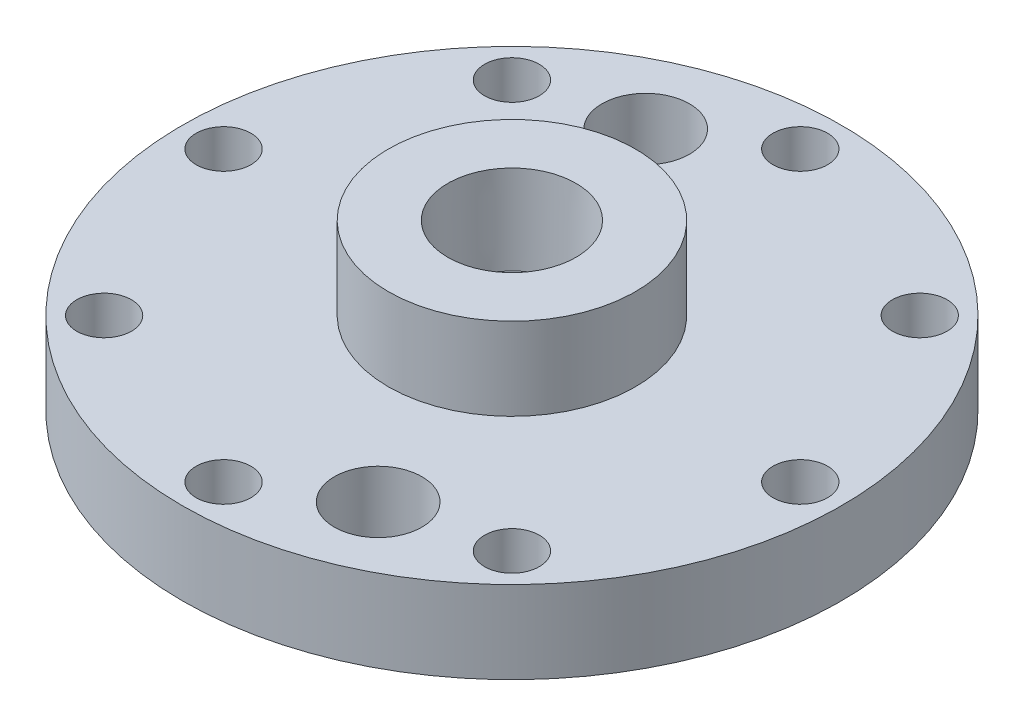
ISO-10303-21;
HEADER;
FILE_DESCRIPTION(('STEP AP214'),'2;1');
FILE_NAME('part.step','',(''),(''),'','','');
FILE_SCHEMA(('AUTOMOTIVE_DESIGN { 1 0 10303 214 1 1 1 1 }'));
ENDSEC;
DATA;
#1=APPLICATION_CONTEXT('core data for automotive mechanical design processes');
#2=APPLICATION_PROTOCOL_DEFINITION('international standard','automotive_design',2000,#1);
#3=PRODUCT_CONTEXT('',#1,'mechanical');
#4=PRODUCT('Part','Part','',(#3));
#5=PRODUCT_RELATED_PRODUCT_CATEGORY('part','',(#4));
#6=PRODUCT_DEFINITION_FORMATION('','',#4);
#7=PRODUCT_DEFINITION_CONTEXT('part definition',#1,'design');
#8=PRODUCT_DEFINITION('design','',#6,#7);
#9=PRODUCT_DEFINITION_SHAPE('','',#8);
#10=(LENGTH_UNIT() NAMED_UNIT(*) SI_UNIT(.MILLI.,.METRE.));
#11=(NAMED_UNIT(*) PLANE_ANGLE_UNIT() SI_UNIT($,.RADIAN.));
#12=(NAMED_UNIT(*) SI_UNIT($,.STERADIAN.) SOLID_ANGLE_UNIT());
#13=UNCERTAINTY_MEASURE_WITH_UNIT(LENGTH_MEASURE(1.E-05),#10,'distance_accuracy_value','');
#14=(GEOMETRIC_REPRESENTATION_CONTEXT(3) GLOBAL_UNCERTAINTY_ASSIGNED_CONTEXT((#13)) GLOBAL_UNIT_ASSIGNED_CONTEXT((#10,
#11,#12)) REPRESENTATION_CONTEXT('',''));
#15=CARTESIAN_POINT('',(0.,0.,0.));
#16=DIRECTION('',(0.,0.,1.));
#17=DIRECTION('',(1.,0.,0.));
#18=AXIS2_PLACEMENT_3D('',#15,#16,#17);
#19=CARTESIAN_POINT('',(-15.875,0.,0.));
#20=DIRECTION('',(0.,-1.,0.));
#21=DIRECTION('',(0.,0.,-1.));
#22=AXIS2_PLACEMENT_3D('',#19,#20,#21);
#23=PLANE('',#22);
#24=CARTESIAN_POINT('',(0.,0.,0.));
#25=DIRECTION('',(0.,1.,0.));
#26=DIRECTION('',(0.,0.,1.));
#27=AXIS2_PLACEMENT_3D('',#24,#25,#26);
#28=CIRCLE('',#27,8.9281);
#29=CARTESIAN_POINT('',(0.,0.,8.9281));
#30=VERTEX_POINT('',#29);
#31=EDGE_CURVE('E76',#30,#30,#28,.T.);
#32=ORIENTED_EDGE('',*,*,#31,.T.);
#33=EDGE_LOOP('',(#32));
#34=FACE_BOUND('',#33,.T.);
#35=CARTESIAN_POINT('',(0.,0.,0.));
#36=DIRECTION('',(0.,1.,0.));
#37=DIRECTION('',(0.,0.,1.));
#38=AXIS2_PLACEMENT_3D('',#35,#36,#37);
#39=CIRCLE('',#38,15.875);
#40=CARTESIAN_POINT('',(0.,0.,15.875));
#41=VERTEX_POINT('',#40);
#42=EDGE_CURVE('E10',#41,#41,#39,.T.);
#43=ORIENTED_EDGE('',*,*,#42,.F.);
#44=EDGE_LOOP('',(#43));
#45=FACE_BOUND('',#44,.T.);
#46=ADVANCED_FACE('F45',(#34,#45),#23,.T.);
#47=CARTESIAN_POINT('',(0.,25.4,0.));
#48=DIRECTION('',(0.,1.,0.));
#49=DIRECTION('',(0.,0.,1.));
#50=AXIS2_PLACEMENT_3D('',#47,#48,#49);
#51=CYLINDRICAL_SURFACE('',#50,15.875);
#52=ORIENTED_EDGE('',*,*,#42,.T.);
#53=EDGE_LOOP('',(#52));
#54=FACE_BOUND('',#53,.T.);
#55=CARTESIAN_POINT('',(0.,2.54,0.));
#56=DIRECTION('',(0.,1.,0.));
#57=DIRECTION('',(0.,0.,1.));
#58=AXIS2_PLACEMENT_3D('',#55,#56,#57);
#59=CIRCLE('',#58,15.875);
#60=CARTESIAN_POINT('',(0.,2.54,15.875));
#61=VERTEX_POINT('',#60);
#62=EDGE_CURVE('E51',#61,#61,#59,.T.);
#63=ORIENTED_EDGE('',*,*,#62,.F.);
#64=EDGE_LOOP('',(#63));
#65=FACE_BOUND('',#64,.T.);
#66=ADVANCED_FACE('F197',(#54,#65),#51,.T.);
#67=CARTESIAN_POINT('',(-19.431,2.54,0.));
#68=DIRECTION('',(0.,-1.,0.));
#69=DIRECTION('',(0.,0.,-1.));
#70=AXIS2_PLACEMENT_3D('',#67,#68,#69);
#71=PLANE('',#70);
#72=ORIENTED_EDGE('',*,*,#62,.T.);
#73=EDGE_LOOP('',(#72));
#74=FACE_BOUND('',#73,.T.);
#75=CARTESIAN_POINT('',(0.,2.54,0.));
#76=DIRECTION('',(0.,1.,0.));
#77=DIRECTION('',(0.,0.,1.));
#78=AXIS2_PLACEMENT_3D('',#75,#76,#77);
#79=CIRCLE('',#78,19.431);
#80=CARTESIAN_POINT('',(0.,2.54,19.431));
#81=VERTEX_POINT('',#80);
#82=EDGE_CURVE('E55',#81,#81,#79,.T.);
#83=ORIENTED_EDGE('',*,*,#82,.F.);
#84=EDGE_LOOP('',(#83));
#85=FACE_BOUND('',#84,.T.);
#86=ADVANCED_FACE('F202',(#74,#85),#71,.T.);
#87=CARTESIAN_POINT('',(0.,25.4,0.));
#88=DIRECTION('',(0.,1.,0.));
#89=DIRECTION('',(0.,0.,1.));
#90=AXIS2_PLACEMENT_3D('',#87,#88,#89);
#91=CYLINDRICAL_SURFACE('',#90,19.431);
#92=ORIENTED_EDGE('',*,*,#82,.T.);
#93=EDGE_LOOP('',(#92));
#94=FACE_BOUND('',#93,.T.);
#95=CARTESIAN_POINT('',(0.,0.,0.));
#96=DIRECTION('',(0.,1.,0.));
#97=DIRECTION('',(0.,0.,1.));
#98=AXIS2_PLACEMENT_3D('',#95,#96,#97);
#99=CIRCLE('',#98,19.431);
#100=CARTESIAN_POINT('',(0.,0.,19.431));
#101=VERTEX_POINT('',#100);
#102=EDGE_CURVE('E59',#101,#101,#99,.T.);
#103=ORIENTED_EDGE('',*,*,#102,.F.);
#104=EDGE_LOOP('',(#103));
#105=FACE_BOUND('',#104,.T.);
#106=ADVANCED_FACE('F265',(#94,#105),#91,.F.);
#107=CARTESIAN_POINT('',(-19.431,0.,0.));
#108=DIRECTION('',(0.,-1.,0.));
#109=DIRECTION('',(0.,0.,-1.));
#110=AXIS2_PLACEMENT_3D('',#107,#108,#109);
#111=PLANE('',#110);
#112=CARTESIAN_POINT('',(14.5802387731099,0.,35.19981018868));
#113=DIRECTION('',(0.,1.,0.));
#114=DIRECTION('',(0.,0.,1.));
#115=AXIS2_PLACEMENT_3D('',#112,#113,#114);
#116=CIRCLE('',#115,6.74624);
#117=CARTESIAN_POINT('',(14.5802387731099,0.,41.94605018868));
#118=VERTEX_POINT('',#117);
#119=EDGE_CURVE('E142',#118,#118,#116,.T.);
#120=ORIENTED_EDGE('',*,*,#119,.T.);
#121=EDGE_LOOP('',(#120));
#122=FACE_BOUND('',#121,.T.);
#123=CARTESIAN_POINT('',(-14.5802387731099,0.,-35.19981018868));
#124=DIRECTION('',(0.,1.,0.));
#125=DIRECTION('',(0.,0.,1.));
#126=AXIS2_PLACEMENT_3D('',#123,#124,#125);
#127=CIRCLE('',#126,6.74624);
#128=CARTESIAN_POINT('',(-14.5802387731099,0.,-28.45357018868));
#129=VERTEX_POINT('',#128);
#130=EDGE_CURVE('E136',#129,#129,#127,.T.);
#131=ORIENTED_EDGE('',*,*,#130,.T.);
#132=EDGE_LOOP('',(#131));
#133=FACE_BOUND('',#132,.T.);
#134=CARTESIAN_POINT('',(31.4308964237424,0.,-31.4308964237417));
#135=DIRECTION('',(0.,1.,0.));
#136=DIRECTION('',(0.,0.,1.));
#137=AXIS2_PLACEMENT_3D('',#134,#135,#136);
#138=CIRCLE('',#137,4.21639999999999);
#139=CARTESIAN_POINT('',(31.4308964237424,0.,-27.2144964237417));
#140=VERTEX_POINT('',#139);
#141=EDGE_CURVE('E130',#140,#140,#138,.T.);
#142=ORIENTED_EDGE('',*,*,#141,.T.);
#143=EDGE_LOOP('',(#142));
#144=FACE_BOUND('',#143,.T.);
#145=CARTESIAN_POINT('',(4.65589036534732E-13,0.,-44.45));
#146=DIRECTION('',(0.,1.,0.));
#147=DIRECTION('',(0.,0.,1.));
#148=AXIS2_PLACEMENT_3D('',#145,#146,#147);
#149=CIRCLE('',#148,4.2164);
#150=CARTESIAN_POINT('',(4.65589036534732E-13,0.,-40.2336));
#151=VERTEX_POINT('',#150);
#152=EDGE_CURVE('E124',#151,#151,#149,.T.);
#153=ORIENTED_EDGE('',*,*,#152,.T.);
#154=EDGE_LOOP('',(#153));
#155=FACE_BOUND('',#154,.T.);
#156=CARTESIAN_POINT('',(-31.4308964237418,0.,-31.4308964237423));
#157=DIRECTION('',(0.,1.,0.));
#158=DIRECTION('',(0.,0.,1.));
#159=AXIS2_PLACEMENT_3D('',#156,#157,#158);
#160=CIRCLE('',#159,4.21639999999999);
#161=CARTESIAN_POINT('',(-31.4308964237418,0.,-27.2144964237423));
#162=VERTEX_POINT('',#161);
#163=EDGE_CURVE('E118',#162,#162,#160,.T.);
#164=ORIENTED_EDGE('',*,*,#163,.T.);
#165=EDGE_LOOP('',(#164));
#166=FACE_BOUND('',#165,.T.);
#167=CARTESIAN_POINT('',(-44.45,0.,0.));
#168=DIRECTION('',(0.,1.,0.));
#169=DIRECTION('',(0.,0.,1.));
#170=AXIS2_PLACEMENT_3D('',#167,#168,#169);
#171=CIRCLE('',#170,4.21639999999999);
#172=CARTESIAN_POINT('',(-44.45,0.,4.21639999999999));
#173=VERTEX_POINT('',#172);
#174=EDGE_CURVE('E112',#173,#173,#171,.T.);
#175=ORIENTED_EDGE('',*,*,#174,.T.);
#176=EDGE_LOOP('',(#175));
#177=FACE_BOUND('',#176,.T.);
#178=CARTESIAN_POINT('',(-31.4308964237422,0.,31.4308964237419));
#179=DIRECTION('',(0.,1.,0.));
#180=DIRECTION('',(0.,0.,1.));
#181=AXIS2_PLACEMENT_3D('',#178,#179,#180);
#182=CIRCLE('',#181,4.21639999999999);
#183=CARTESIAN_POINT('',(-31.4308964237422,0.,35.6472964237419));
#184=VERTEX_POINT('',#183);
#185=EDGE_CURVE('E106',#184,#184,#182,.T.);
#186=ORIENTED_EDGE('',*,*,#185,.T.);
#187=EDGE_LOOP('',(#186));
#188=FACE_BOUND('',#187,.T.);
#189=CARTESIAN_POINT('',(-1.55196345511577E-13,0.,44.45));
#190=DIRECTION('',(0.,1.,0.));
#191=DIRECTION('',(0.,0.,1.));
#192=AXIS2_PLACEMENT_3D('',#189,#190,#191);
#193=CIRCLE('',#192,4.2164);
#194=CARTESIAN_POINT('',(-1.55196345511577E-13,0.,48.6664));
#195=VERTEX_POINT('',#194);
#196=EDGE_CURVE('E100',#195,#195,#193,.T.);
#197=ORIENTED_EDGE('',*,*,#196,.T.);
#198=EDGE_LOOP('',(#197));
#199=FACE_BOUND('',#198,.T.);
#200=CARTESIAN_POINT('',(31.430896423742,0.,31.4308964237421));
#201=DIRECTION('',(0.,1.,0.));
#202=DIRECTION('',(0.,0.,1.));
#203=AXIS2_PLACEMENT_3D('',#200,#201,#202);
#204=CIRCLE('',#203,4.21639999999999);
#205=CARTESIAN_POINT('',(31.430896423742,0.,35.6472964237421));
#206=VERTEX_POINT('',#205);
#207=EDGE_CURVE('E94',#206,#206,#204,.T.);
#208=ORIENTED_EDGE('',*,*,#207,.T.);
#209=EDGE_LOOP('',(#208));
#210=FACE_BOUND('',#209,.T.);
#211=CARTESIAN_POINT('',(44.45,0.,0.));
#212=DIRECTION('',(0.,1.,0.));
#213=DIRECTION('',(0.,0.,1.));
#214=AXIS2_PLACEMENT_3D('',#211,#212,#213);
#215=CIRCLE('',#214,4.21639999999999);
#216=CARTESIAN_POINT('',(44.45,0.,4.21639999999999));
#217=VERTEX_POINT('',#216);
#218=EDGE_CURVE('E88',#217,#217,#215,.T.);
#219=ORIENTED_EDGE('',*,*,#218,.T.);
#220=EDGE_LOOP('',(#219));
#221=FACE_BOUND('',#220,.T.);
#222=ORIENTED_EDGE('',*,*,#102,.T.);
#223=EDGE_LOOP('',(#222));
#224=FACE_BOUND('',#223,.T.);
#225=CARTESIAN_POINT('',(0.,0.,0.));
#226=DIRECTION('',(0.,1.,0.));
#227=DIRECTION('',(0.,0.,1.));
#228=AXIS2_PLACEMENT_3D('',#225,#226,#227);
#229=CIRCLE('',#228,50.8);
#230=CARTESIAN_POINT('',(0.,0.,50.8));
#231=VERTEX_POINT('',#230);
#232=EDGE_CURVE('E64',#231,#231,#229,.T.);
#233=ORIENTED_EDGE('',*,*,#232,.F.);
#234=EDGE_LOOP('',(#233));
#235=FACE_BOUND('',#234,.T.);
#236=ADVANCED_FACE('F262',(#122,#133,#144,#155,#166,#177,#188,#199,#210,#221,#224,#235),#111,.T.);
#237=CARTESIAN_POINT('',(0.,25.4,0.));
#238=DIRECTION('',(0.,1.,0.));
#239=DIRECTION('',(0.,0.,1.));
#240=AXIS2_PLACEMENT_3D('',#237,#238,#239);
#241=CYLINDRICAL_SURFACE('',#240,50.8);
#242=ORIENTED_EDGE('',*,*,#232,.T.);
#243=EDGE_LOOP('',(#242));
#244=FACE_BOUND('',#243,.T.);
#245=CARTESIAN_POINT('',(0.,12.7,0.));
#246=DIRECTION('',(0.,1.,0.));
#247=DIRECTION('',(0.,0.,1.));
#248=AXIS2_PLACEMENT_3D('',#245,#246,#247);
#249=CIRCLE('',#248,50.8);
#250=CARTESIAN_POINT('',(0.,12.7,50.8));
#251=VERTEX_POINT('',#250);
#252=EDGE_CURVE('E67',#251,#251,#249,.T.);
#253=ORIENTED_EDGE('',*,*,#252,.F.);
#254=EDGE_LOOP('',(#253));
#255=FACE_BOUND('',#254,.T.);
#256=ADVANCED_FACE('F155',(#244,#255),#241,.T.);
#257=CARTESIAN_POINT('',(-50.8,12.7,0.));
#258=DIRECTION('',(0.,1.,0.));
#259=DIRECTION('',(0.,0.,1.));
#260=AXIS2_PLACEMENT_3D('',#257,#258,#259);
#261=PLANE('',#260);
#262=CARTESIAN_POINT('',(14.5802387731099,12.7,35.19981018868));
#263=DIRECTION('',(0.,1.,0.));
#264=DIRECTION('',(0.,0.,1.));
#265=AXIS2_PLACEMENT_3D('',#262,#263,#264);
#266=CIRCLE('',#265,6.74624);
#267=CARTESIAN_POINT('',(14.5802387731099,12.7,41.94605018868));
#268=VERTEX_POINT('',#267);
#269=EDGE_CURVE('E145',#268,#268,#266,.T.);
#270=ORIENTED_EDGE('',*,*,#269,.F.);
#271=EDGE_LOOP('',(#270));
#272=FACE_BOUND('',#271,.T.);
#273=CARTESIAN_POINT('',(-14.5802387731099,12.7,-35.19981018868));
#274=DIRECTION('',(0.,1.,0.));
#275=DIRECTION('',(0.,0.,1.));
#276=AXIS2_PLACEMENT_3D('',#273,#274,#275);
#277=CIRCLE('',#276,6.74624);
#278=CARTESIAN_POINT('',(-14.5802387731099,12.7,-28.45357018868));
#279=VERTEX_POINT('',#278);
#280=EDGE_CURVE('E139',#279,#279,#277,.T.);
#281=ORIENTED_EDGE('',*,*,#280,.F.);
#282=EDGE_LOOP('',(#281));
#283=FACE_BOUND('',#282,.T.);
#284=CARTESIAN_POINT('',(31.4308964237424,12.7,-31.4308964237417));
#285=DIRECTION('',(0.,1.,0.));
#286=DIRECTION('',(0.,0.,1.));
#287=AXIS2_PLACEMENT_3D('',#284,#285,#286);
#288=CIRCLE('',#287,4.21639999999999);
#289=CARTESIAN_POINT('',(31.4308964237424,12.7,-27.2144964237417));
#290=VERTEX_POINT('',#289);
#291=EDGE_CURVE('E133',#290,#290,#288,.T.);
#292=ORIENTED_EDGE('',*,*,#291,.F.);
#293=EDGE_LOOP('',(#292));
#294=FACE_BOUND('',#293,.T.);
#295=CARTESIAN_POINT('',(4.65589036534732E-13,12.7,-44.45));
#296=DIRECTION('',(0.,1.,0.));
#297=DIRECTION('',(0.,0.,1.));
#298=AXIS2_PLACEMENT_3D('',#295,#296,#297);
#299=CIRCLE('',#298,4.2164);
#300=CARTESIAN_POINT('',(4.65589036534732E-13,12.7,-40.2336));
#301=VERTEX_POINT('',#300);
#302=EDGE_CURVE('E127',#301,#301,#299,.T.);
#303=ORIENTED_EDGE('',*,*,#302,.F.);
#304=EDGE_LOOP('',(#303));
#305=FACE_BOUND('',#304,.T.);
#306=CARTESIAN_POINT('',(-31.4308964237418,12.7,-31.4308964237423));
#307=DIRECTION('',(0.,1.,0.));
#308=DIRECTION('',(0.,0.,1.));
#309=AXIS2_PLACEMENT_3D('',#306,#307,#308);
#310=CIRCLE('',#309,4.2164);
#311=CARTESIAN_POINT('',(-31.4308964237418,12.7,-27.2144964237423));
#312=VERTEX_POINT('',#311);
#313=EDGE_CURVE('E121',#312,#312,#310,.T.);
#314=ORIENTED_EDGE('',*,*,#313,.F.);
#315=EDGE_LOOP('',(#314));
#316=FACE_BOUND('',#315,.T.);
#317=CARTESIAN_POINT('',(-44.45,12.7,0.));
#318=DIRECTION('',(0.,1.,0.));
#319=DIRECTION('',(0.,0.,1.));
#320=AXIS2_PLACEMENT_3D('',#317,#318,#319);
#321=CIRCLE('',#320,4.2164);
#322=CARTESIAN_POINT('',(-44.45,12.7,4.2164));
#323=VERTEX_POINT('',#322);
#324=EDGE_CURVE('E115',#323,#323,#321,.T.);
#325=ORIENTED_EDGE('',*,*,#324,.F.);
#326=EDGE_LOOP('',(#325));
#327=FACE_BOUND('',#326,.T.);
#328=CARTESIAN_POINT('',(-31.4308964237422,12.7,31.4308964237419));
#329=DIRECTION('',(0.,1.,0.));
#330=DIRECTION('',(0.,0.,1.));
#331=AXIS2_PLACEMENT_3D('',#328,#329,#330);
#332=CIRCLE('',#331,4.2164);
#333=CARTESIAN_POINT('',(-31.4308964237422,12.7,35.6472964237419));
#334=VERTEX_POINT('',#333);
#335=EDGE_CURVE('E109',#334,#334,#332,.T.);
#336=ORIENTED_EDGE('',*,*,#335,.F.);
#337=EDGE_LOOP('',(#336));
#338=FACE_BOUND('',#337,.T.);
#339=CARTESIAN_POINT('',(-1.55196345511577E-13,12.7,44.45));
#340=DIRECTION('',(0.,1.,0.));
#341=DIRECTION('',(0.,0.,1.));
#342=AXIS2_PLACEMENT_3D('',#339,#340,#341);
#343=CIRCLE('',#342,4.2164);
#344=CARTESIAN_POINT('',(-1.55196345511577E-13,12.7,48.6664));
#345=VERTEX_POINT('',#344);
#346=EDGE_CURVE('E103',#345,#345,#343,.T.);
#347=ORIENTED_EDGE('',*,*,#346,.F.);
#348=EDGE_LOOP('',(#347));
#349=FACE_BOUND('',#348,.T.);
#350=CARTESIAN_POINT('',(31.430896423742,12.7,31.4308964237421));
#351=DIRECTION('',(0.,1.,0.));
#352=DIRECTION('',(0.,0.,1.));
#353=AXIS2_PLACEMENT_3D('',#350,#351,#352);
#354=CIRCLE('',#353,4.21639999999999);
#355=CARTESIAN_POINT('',(31.430896423742,12.7,35.6472964237421));
#356=VERTEX_POINT('',#355);
#357=EDGE_CURVE('E97',#356,#356,#354,.T.);
#358=ORIENTED_EDGE('',*,*,#357,.F.);
#359=EDGE_LOOP('',(#358));
#360=FACE_BOUND('',#359,.T.);
#361=CARTESIAN_POINT('',(44.45,12.7,0.));
#362=DIRECTION('',(0.,1.,0.));
#363=DIRECTION('',(0.,0.,1.));
#364=AXIS2_PLACEMENT_3D('',#361,#362,#363);
#365=CIRCLE('',#364,4.2164);
#366=CARTESIAN_POINT('',(44.45,12.7,4.2164));
#367=VERTEX_POINT('',#366);
#368=EDGE_CURVE('E91',#367,#367,#365,.T.);
#369=ORIENTED_EDGE('',*,*,#368,.F.);
#370=EDGE_LOOP('',(#369));
#371=FACE_BOUND('',#370,.T.);
#372=ORIENTED_EDGE('',*,*,#252,.T.);
#373=EDGE_LOOP('',(#372));
#374=FACE_BOUND('',#373,.T.);
#375=CARTESIAN_POINT('',(0.,12.7,0.));
#376=DIRECTION('',(0.,1.,0.));
#377=DIRECTION('',(0.,0.,1.));
#378=AXIS2_PLACEMENT_3D('',#375,#376,#377);
#379=CIRCLE('',#378,19.05);
#380=CARTESIAN_POINT('',(0.,12.7,19.05));
#381=VERTEX_POINT('',#380);
#382=EDGE_CURVE('E70',#381,#381,#379,.T.);
#383=ORIENTED_EDGE('',*,*,#382,.F.);
#384=EDGE_LOOP('',(#383));
#385=FACE_BOUND('',#384,.T.);
#386=ADVANCED_FACE('F151',(#272,#283,#294,#305,#316,#327,#338,#349,#360,#371,#374,#385),#261,.T.);
#387=CARTESIAN_POINT('',(0.,25.4,0.));
#388=DIRECTION('',(0.,1.,0.));
#389=DIRECTION('',(0.,0.,1.));
#390=AXIS2_PLACEMENT_3D('',#387,#388,#389);
#391=CYLINDRICAL_SURFACE('',#390,19.05);
#392=ORIENTED_EDGE('',*,*,#382,.T.);
#393=EDGE_LOOP('',(#392));
#394=FACE_BOUND('',#393,.T.);
#395=CARTESIAN_POINT('',(0.,25.4,0.));
#396=DIRECTION('',(0.,1.,0.));
#397=DIRECTION('',(0.,0.,1.));
#398=AXIS2_PLACEMENT_3D('',#395,#396,#397);
#399=CIRCLE('',#398,19.05);
#400=CARTESIAN_POINT('',(0.,25.4,19.05));
#401=VERTEX_POINT('',#400);
#402=EDGE_CURVE('E73',#401,#401,#399,.T.);
#403=ORIENTED_EDGE('',*,*,#402,.F.);
#404=EDGE_LOOP('',(#403));
#405=FACE_BOUND('',#404,.T.);
#406=ADVANCED_FACE('F154',(#394,#405),#391,.T.);
#407=CARTESIAN_POINT('',(0.,25.4,0.));
#408=DIRECTION('',(0.,1.,0.));
#409=DIRECTION('',(0.,0.,1.));
#410=AXIS2_PLACEMENT_3D('',#407,#408,#409);
#411=PLANE('',#410);
#412=CARTESIAN_POINT('',(0.,25.4,0.));
#413=DIRECTION('',(0.,1.,0.));
#414=DIRECTION('',(0.,0.,1.));
#415=AXIS2_PLACEMENT_3D('',#412,#413,#414);
#416=CIRCLE('',#415,9.8827971);
#417=CARTESIAN_POINT('',(0.,25.4,9.8827971));
#418=VERTEX_POINT('',#417);
#419=EDGE_CURVE('E85',#418,#418,#416,.T.);
#420=ORIENTED_EDGE('',*,*,#419,.F.);
#421=EDGE_LOOP('',(#420));
#422=FACE_BOUND('',#421,.T.);
#423=ORIENTED_EDGE('',*,*,#402,.T.);
#424=EDGE_LOOP('',(#423));
#425=FACE_BOUND('',#424,.T.);
#426=ADVANCED_FACE('F181',(#422,#425),#411,.T.);
#427=CARTESIAN_POINT('',(0.,25.4,0.));
#428=DIRECTION('',(0.,1.,0.));
#429=DIRECTION('',(0.,0.,1.));
#430=AXIS2_PLACEMENT_3D('',#427,#428,#429);
#431=CYLINDRICAL_SURFACE('',#430,8.9281);
#432=ORIENTED_EDGE('',*,*,#31,.F.);
#433=EDGE_LOOP('',(#432));
#434=FACE_BOUND('',#433,.T.);
#435=CARTESIAN_POINT('',(0.,11.938,0.));
#436=DIRECTION('',(0.,1.,0.));
#437=DIRECTION('',(0.,0.,1.));
#438=AXIS2_PLACEMENT_3D('',#435,#436,#437);
#439=CIRCLE('',#438,8.9281);
#440=CARTESIAN_POINT('',(0.,11.938,8.9281));
#441=VERTEX_POINT('',#440);
#442=EDGE_CURVE('E79',#441,#441,#439,.T.);
#443=ORIENTED_EDGE('',*,*,#442,.T.);
#444=EDGE_LOOP('',(#443));
#445=FACE_BOUND('',#444,.T.);
#446=ADVANCED_FACE('F186',(#434,#445),#431,.F.);
#447=CARTESIAN_POINT('',(8.9281,11.938,0.));
#448=DIRECTION('',(0.,-1.,0.));
#449=DIRECTION('',(0.,0.,-1.));
#450=AXIS2_PLACEMENT_3D('',#447,#448,#449);
#451=PLANE('',#450);
#452=ORIENTED_EDGE('',*,*,#442,.F.);
#453=EDGE_LOOP('',(#452));
#454=FACE_BOUND('',#453,.T.);
#455=CARTESIAN_POINT('',(0.,11.938,0.));
#456=DIRECTION('',(0.,1.,0.));
#457=DIRECTION('',(0.,0.,1.));
#458=AXIS2_PLACEMENT_3D('',#455,#456,#457);
#459=CIRCLE('',#458,9.47972679208631);
#460=CARTESIAN_POINT('',(0.,11.938,9.47972679208631));
#461=VERTEX_POINT('',#460);
#462=EDGE_CURVE('E82',#461,#461,#459,.T.);
#463=ORIENTED_EDGE('',*,*,#462,.T.);
#464=EDGE_LOOP('',(#463));
#465=FACE_BOUND('',#464,.T.);
#466=ADVANCED_FACE('F192',(#454,#465),#451,.F.);
#467=CARTESIAN_POINT('',(0.,25.4,0.));
#468=DIRECTION('',(0.,1.,0.));
#469=DIRECTION('',(0.,0.,1.));
#470=AXIS2_PLACEMENT_3D('',#467,#468,#469);
#471=CONICAL_SURFACE('',#470,9.8827971,0.0299323966717028);
#472=ORIENTED_EDGE('',*,*,#462,.F.);
#473=EDGE_LOOP('',(#472));
#474=FACE_BOUND('',#473,.T.);
#475=ORIENTED_EDGE('',*,*,#419,.T.);
#476=EDGE_LOOP('',(#475));
#477=FACE_BOUND('',#476,.T.);
#478=ADVANCED_FACE('F210',(#474,#477),#471,.F.);
#479=CARTESIAN_POINT('',(44.45,12.7,0.));
#480=DIRECTION('',(0.,1.,0.));
#481=DIRECTION('',(0.,0.,1.));
#482=AXIS2_PLACEMENT_3D('',#479,#480,#481);
#483=CYLINDRICAL_SURFACE('',#482,4.2164);
#484=ORIENTED_EDGE('',*,*,#218,.F.);
#485=EDGE_LOOP('',(#484));
#486=FACE_BOUND('',#485,.T.);
#487=ORIENTED_EDGE('',*,*,#368,.T.);
#488=EDGE_LOOP('',(#487));
#489=FACE_BOUND('',#488,.T.);
#490=ADVANCED_FACE('F216',(#486,#489),#483,.F.);
#491=CARTESIAN_POINT('',(31.430896423742,12.7,31.4308964237421));
#492=DIRECTION('',(0.,1.,0.));
#493=DIRECTION('',(0.,0.,1.));
#494=AXIS2_PLACEMENT_3D('',#491,#492,#493);
#495=CYLINDRICAL_SURFACE('',#494,4.21639999999999);
#496=ORIENTED_EDGE('',*,*,#207,.F.);
#497=EDGE_LOOP('',(#496));
#498=FACE_BOUND('',#497,.T.);
#499=ORIENTED_EDGE('',*,*,#357,.T.);
#500=EDGE_LOOP('',(#499));
#501=FACE_BOUND('',#500,.T.);
#502=ADVANCED_FACE('F221',(#498,#501),#495,.F.);
#503=CARTESIAN_POINT('',(-1.55196345511577E-13,12.7,44.45));
#504=DIRECTION('',(0.,1.,0.));
#505=DIRECTION('',(0.,0.,1.));
#506=AXIS2_PLACEMENT_3D('',#503,#504,#505);
#507=CYLINDRICAL_SURFACE('',#506,4.2164);
#508=ORIENTED_EDGE('',*,*,#196,.F.);
#509=EDGE_LOOP('',(#508));
#510=FACE_BOUND('',#509,.T.);
#511=ORIENTED_EDGE('',*,*,#346,.T.);
#512=EDGE_LOOP('',(#511));
#513=FACE_BOUND('',#512,.T.);
#514=ADVANCED_FACE('F227',(#510,#513),#507,.F.);
#515=CARTESIAN_POINT('',(-31.4308964237422,12.7,31.4308964237419));
#516=DIRECTION('',(0.,1.,0.));
#517=DIRECTION('',(0.,0.,1.));
#518=AXIS2_PLACEMENT_3D('',#515,#516,#517);
#519=CYLINDRICAL_SURFACE('',#518,4.2164);
#520=ORIENTED_EDGE('',*,*,#185,.F.);
#521=EDGE_LOOP('',(#520));
#522=FACE_BOUND('',#521,.T.);
#523=ORIENTED_EDGE('',*,*,#335,.T.);
#524=EDGE_LOOP('',(#523));
#525=FACE_BOUND('',#524,.T.);
#526=ADVANCED_FACE('F231',(#522,#525),#519,.F.);
#527=CARTESIAN_POINT('',(-44.45,12.7,0.));
#528=DIRECTION('',(0.,1.,0.));
#529=DIRECTION('',(0.,0.,1.));
#530=AXIS2_PLACEMENT_3D('',#527,#528,#529);
#531=CYLINDRICAL_SURFACE('',#530,4.2164);
#532=ORIENTED_EDGE('',*,*,#174,.F.);
#533=EDGE_LOOP('',(#532));
#534=FACE_BOUND('',#533,.T.);
#535=ORIENTED_EDGE('',*,*,#324,.T.);
#536=EDGE_LOOP('',(#535));
#537=FACE_BOUND('',#536,.T.);
#538=ADVANCED_FACE('F235',(#534,#537),#531,.F.);
#539=CARTESIAN_POINT('',(-31.4308964237418,12.7,-31.4308964237423));
#540=DIRECTION('',(0.,1.,0.));
#541=DIRECTION('',(0.,0.,1.));
#542=AXIS2_PLACEMENT_3D('',#539,#540,#541);
#543=CYLINDRICAL_SURFACE('',#542,4.2164);
#544=ORIENTED_EDGE('',*,*,#163,.F.);
#545=EDGE_LOOP('',(#544));
#546=FACE_BOUND('',#545,.T.);
#547=ORIENTED_EDGE('',*,*,#313,.T.);
#548=EDGE_LOOP('',(#547));
#549=FACE_BOUND('',#548,.T.);
#550=ADVANCED_FACE('F239',(#546,#549),#543,.F.);
#551=CARTESIAN_POINT('',(4.65589036534732E-13,12.7,-44.45));
#552=DIRECTION('',(0.,1.,0.));
#553=DIRECTION('',(0.,0.,1.));
#554=AXIS2_PLACEMENT_3D('',#551,#552,#553);
#555=CYLINDRICAL_SURFACE('',#554,4.2164);
#556=ORIENTED_EDGE('',*,*,#152,.F.);
#557=EDGE_LOOP('',(#556));
#558=FACE_BOUND('',#557,.T.);
#559=ORIENTED_EDGE('',*,*,#302,.T.);
#560=EDGE_LOOP('',(#559));
#561=FACE_BOUND('',#560,.T.);
#562=ADVANCED_FACE('F243',(#558,#561),#555,.F.);
#563=CARTESIAN_POINT('',(31.4308964237424,12.7,-31.4308964237417));
#564=DIRECTION('',(0.,1.,0.));
#565=DIRECTION('',(0.,0.,1.));
#566=AXIS2_PLACEMENT_3D('',#563,#564,#565);
#567=CYLINDRICAL_SURFACE('',#566,4.21639999999999);
#568=ORIENTED_EDGE('',*,*,#141,.F.);
#569=EDGE_LOOP('',(#568));
#570=FACE_BOUND('',#569,.T.);
#571=ORIENTED_EDGE('',*,*,#291,.T.);
#572=EDGE_LOOP('',(#571));
#573=FACE_BOUND('',#572,.T.);
#574=ADVANCED_FACE('F247',(#570,#573),#567,.F.);
#575=CARTESIAN_POINT('',(-14.5802387731099,12.7,-35.19981018868));
#576=DIRECTION('',(0.,1.,0.));
#577=DIRECTION('',(0.,0.,1.));
#578=AXIS2_PLACEMENT_3D('',#575,#576,#577);
#579=CYLINDRICAL_SURFACE('',#578,6.74624);
#580=ORIENTED_EDGE('',*,*,#130,.F.);
#581=EDGE_LOOP('',(#580));
#582=FACE_BOUND('',#581,.T.);
#583=ORIENTED_EDGE('',*,*,#280,.T.);
#584=EDGE_LOOP('',(#583));
#585=FACE_BOUND('',#584,.T.);
#586=ADVANCED_FACE('F251',(#582,#585),#579,.F.);
#587=CARTESIAN_POINT('',(14.5802387731099,12.7,35.19981018868));
#588=DIRECTION('',(0.,1.,0.));
#589=DIRECTION('',(0.,0.,1.));
#590=AXIS2_PLACEMENT_3D('',#587,#588,#589);
#591=CYLINDRICAL_SURFACE('',#590,6.74624);
#592=ORIENTED_EDGE('',*,*,#119,.F.);
#593=EDGE_LOOP('',(#592));
#594=FACE_BOUND('',#593,.T.);
#595=ORIENTED_EDGE('',*,*,#269,.T.);
#596=EDGE_LOOP('',(#595));
#597=FACE_BOUND('',#596,.T.);
#598=ADVANCED_FACE('F149',(#594,#597),#591,.F.);
#599=CLOSED_SHELL('',(#46,#66,#86,#106,#236,#256,#386,#406,#426,#446,#466,#478,#490,#502,#514,
#526,#538,#550,#562,#574,#586,#598));
#600=MANIFOLD_SOLID_BREP('B2',#599);
#601=ADVANCED_BREP_SHAPE_REPRESENTATION('',(#18,#600),#14);
#602=SHAPE_DEFINITION_REPRESENTATION(#9,#601);
ENDSEC;
END-ISO-10303-21;
